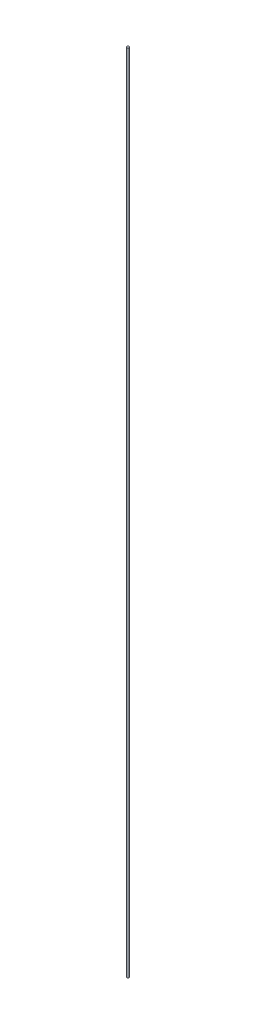
ISO-10303-21;
HEADER;
FILE_DESCRIPTION(('STEP AP214'),'2;1');
FILE_NAME('part.step','',(''),(''),'','','');
FILE_SCHEMA(('AUTOMOTIVE_DESIGN { 1 0 10303 214 1 1 1 1 }'));
ENDSEC;
DATA;
#1=APPLICATION_CONTEXT('core data for automotive mechanical design processes');
#2=APPLICATION_PROTOCOL_DEFINITION('international standard','automotive_design',2000,#1);
#3=PRODUCT_CONTEXT('',#1,'mechanical');
#4=PRODUCT('Part','Part','',(#3));
#5=PRODUCT_RELATED_PRODUCT_CATEGORY('part','',(#4));
#6=PRODUCT_DEFINITION_FORMATION('','',#4);
#7=PRODUCT_DEFINITION_CONTEXT('part definition',#1,'design');
#8=PRODUCT_DEFINITION('design','',#6,#7);
#9=PRODUCT_DEFINITION_SHAPE('','',#8);
#10=(LENGTH_UNIT() NAMED_UNIT(*) SI_UNIT(.MILLI.,.METRE.));
#11=(NAMED_UNIT(*) PLANE_ANGLE_UNIT() SI_UNIT($,.RADIAN.));
#12=(NAMED_UNIT(*) SI_UNIT($,.STERADIAN.) SOLID_ANGLE_UNIT());
#13=UNCERTAINTY_MEASURE_WITH_UNIT(LENGTH_MEASURE(1.E-05),#10,'distance_accuracy_value','');
#14=(GEOMETRIC_REPRESENTATION_CONTEXT(3) GLOBAL_UNCERTAINTY_ASSIGNED_CONTEXT((#13)) GLOBAL_UNIT_ASSIGNED_CONTEXT((#10,
#11,#12)) REPRESENTATION_CONTEXT('',''));
#15=CARTESIAN_POINT('',(0.,0.,0.));
#16=DIRECTION('',(0.,0.,1.));
#17=DIRECTION('',(1.,0.,0.));
#18=AXIS2_PLACEMENT_3D('',#15,#16,#17);
#19=CARTESIAN_POINT('',(0.,491.,0.));
#20=DIRECTION('',(0.,-1.,0.));
#21=DIRECTION('',(0.,0.,-1.));
#22=AXIS2_PLACEMENT_3D('',#19,#20,#21);
#23=CYLINDRICAL_SURFACE('',#22,0.75);
#24=CARTESIAN_POINT('',(0.,491.,0.));
#25=DIRECTION('',(0.,1.,0.));
#26=DIRECTION('',(0.,0.,1.));
#27=AXIS2_PLACEMENT_3D('',#24,#25,#26);
#28=CIRCLE('',#27,0.75);
#29=CARTESIAN_POINT('',(0.,491.,0.75));
#30=VERTEX_POINT('',#29);
#31=EDGE_CURVE('E10',#30,#30,#28,.T.);
#32=ORIENTED_EDGE('',*,*,#31,.F.);
#33=EDGE_LOOP('',(#32));
#34=FACE_BOUND('',#33,.T.);
#35=CARTESIAN_POINT('',(0.,0.,0.));
#36=DIRECTION('',(0.,1.,0.));
#37=DIRECTION('',(0.,0.,1.));
#38=AXIS2_PLACEMENT_3D('',#35,#36,#37);
#39=CIRCLE('',#38,0.75);
#40=CARTESIAN_POINT('',(0.,0.,0.75));
#41=VERTEX_POINT('',#40);
#42=EDGE_CURVE('E40',#41,#41,#39,.T.);
#43=ORIENTED_EDGE('',*,*,#42,.T.);
#44=EDGE_LOOP('',(#43));
#45=FACE_BOUND('',#44,.T.);
#46=ADVANCED_FACE('F37',(#34,#45),#23,.T.);
#47=CARTESIAN_POINT('',(0.,491.,0.));
#48=DIRECTION('',(0.,1.,0.));
#49=DIRECTION('',(0.,0.,1.));
#50=AXIS2_PLACEMENT_3D('',#47,#48,#49);
#51=PLANE('',#50);
#52=ORIENTED_EDGE('',*,*,#31,.T.);
#53=EDGE_LOOP('',(#52));
#54=FACE_BOUND('',#53,.T.);
#55=ADVANCED_FACE('F52',(#54),#51,.T.);
#56=CARTESIAN_POINT('',(0.,0.,0.));
#57=DIRECTION('',(0.,1.,0.));
#58=DIRECTION('',(0.,0.,1.));
#59=AXIS2_PLACEMENT_3D('',#56,#57,#58);
#60=PLANE('',#59);
#61=ORIENTED_EDGE('',*,*,#42,.F.);
#62=EDGE_LOOP('',(#61));
#63=FACE_BOUND('',#62,.T.);
#64=ADVANCED_FACE('F50',(#63),#60,.F.);
#65=CLOSED_SHELL('',(#46,#55,#64));
#66=MANIFOLD_SOLID_BREP('B2',#65);
#67=ADVANCED_BREP_SHAPE_REPRESENTATION('',(#18,#66),#14);
#68=SHAPE_DEFINITION_REPRESENTATION(#9,#67);
ENDSEC;
END-ISO-10303-21;
